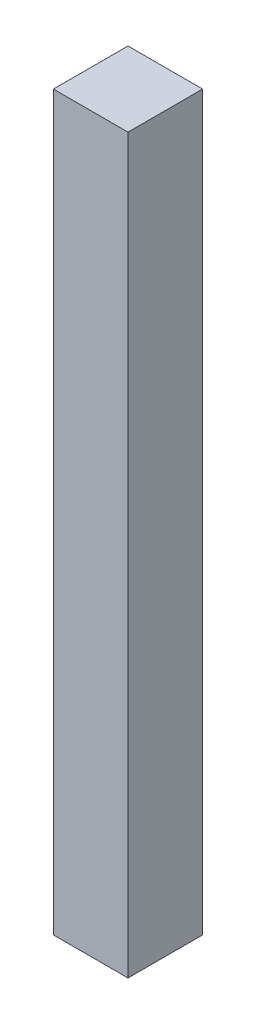
ISO-10303-21;
HEADER;
FILE_DESCRIPTION(('STEP AP214'),'2;1');
FILE_NAME('part.step','',(''),(''),'','','');
FILE_SCHEMA(('AUTOMOTIVE_DESIGN { 1 0 10303 214 1 1 1 1 }'));
ENDSEC;
DATA;
#1=APPLICATION_CONTEXT('core data for automotive mechanical design processes');
#2=APPLICATION_PROTOCOL_DEFINITION('international standard','automotive_design',2000,#1);
#3=PRODUCT_CONTEXT('',#1,'mechanical');
#4=PRODUCT('Part','Part','',(#3));
#5=PRODUCT_RELATED_PRODUCT_CATEGORY('part','',(#4));
#6=PRODUCT_DEFINITION_FORMATION('','',#4);
#7=PRODUCT_DEFINITION_CONTEXT('part definition',#1,'design');
#8=PRODUCT_DEFINITION('design','',#6,#7);
#9=PRODUCT_DEFINITION_SHAPE('','',#8);
#10=(LENGTH_UNIT() NAMED_UNIT(*) SI_UNIT(.MILLI.,.METRE.));
#11=(NAMED_UNIT(*) PLANE_ANGLE_UNIT() SI_UNIT($,.RADIAN.));
#12=(NAMED_UNIT(*) SI_UNIT($,.STERADIAN.) SOLID_ANGLE_UNIT());
#13=UNCERTAINTY_MEASURE_WITH_UNIT(LENGTH_MEASURE(1.E-05),#10,'distance_accuracy_value','');
#14=(GEOMETRIC_REPRESENTATION_CONTEXT(3) GLOBAL_UNCERTAINTY_ASSIGNED_CONTEXT((#13)) GLOBAL_UNIT_ASSIGNED_CONTEXT((#10,
#11,#12)) REPRESENTATION_CONTEXT('',''));
#15=CARTESIAN_POINT('',(0.,0.,0.));
#16=DIRECTION('',(0.,0.,1.));
#17=DIRECTION('',(1.,0.,0.));
#18=AXIS2_PLACEMENT_3D('',#15,#16,#17);
#19=CARTESIAN_POINT('',(16.87,6.43,6.29));
#20=DIRECTION('',(1.,0.,0.));
#21=DIRECTION('',(0.,0.,-1.));
#22=AXIS2_PLACEMENT_3D('',#19,#20,#21);
#23=PLANE('',#22);
#24=DIRECTION('',(0.,1.,0.));
#25=VECTOR('',#24,1.);
#26=CARTESIAN_POINT('',(16.87,3.975,5.79));
#27=LINE('',#26,#25);
#28=CARTESIAN_POINT('',(16.87,6.43,5.79));
#29=VERTEX_POINT('',#28);
#30=CARTESIAN_POINT('',(16.87,1.52,5.79));
#31=VERTEX_POINT('',#30);
#32=EDGE_CURVE('E55',#29,#31,#27,.F.);
#33=ORIENTED_EDGE('',*,*,#32,.F.);
#34=DIRECTION('',(0.,0.,1.));
#35=VECTOR('',#34,1.);
#36=CARTESIAN_POINT('',(16.87,6.43,6.29));
#37=LINE('',#36,#35);
#38=CARTESIAN_POINT('',(16.87,6.43,6.29));
#39=VERTEX_POINT('',#38);
#40=EDGE_CURVE('E67',#39,#29,#37,.F.);
#41=ORIENTED_EDGE('',*,*,#40,.F.);
#42=DIRECTION('',(0.,1.,0.));
#43=VECTOR('',#42,1.);
#44=CARTESIAN_POINT('',(16.87,3.975,6.29));
#45=LINE('',#44,#43);
#46=CARTESIAN_POINT('',(16.87,1.52,6.29));
#47=VERTEX_POINT('',#46);
#48=EDGE_CURVE('E20',#39,#47,#45,.F.);
#49=ORIENTED_EDGE('',*,*,#48,.T.);
#50=DIRECTION('',(0.,0.,-1.));
#51=VECTOR('',#50,1.);
#52=CARTESIAN_POINT('',(16.87,1.52,6.29));
#53=LINE('',#52,#51);
#54=EDGE_CURVE('E81',#31,#47,#53,.F.);
#55=ORIENTED_EDGE('',*,*,#54,.F.);
#56=EDGE_LOOP('',(#33,#41,#49,#55));
#57=FACE_BOUND('',#56,.T.);
#58=ADVANCED_FACE('F17',(#57),#23,.T.);
#59=CARTESIAN_POINT('',(16.62,3.975,6.29));
#60=DIRECTION('',(0.,0.,-1.));
#61=DIRECTION('',(-1.,0.,0.));
#62=AXIS2_PLACEMENT_3D('',#59,#60,#61);
#63=PLANE('',#62);
#64=DIRECTION('',(1.,0.,0.));
#65=VECTOR('',#64,1.);
#66=CARTESIAN_POINT('',(16.37,6.43,6.29));
#67=LINE('',#66,#65);
#68=CARTESIAN_POINT('',(16.37,6.43,6.29));
#69=VERTEX_POINT('',#68);
#70=EDGE_CURVE('E62',#69,#39,#67,.T.);
#71=ORIENTED_EDGE('',*,*,#70,.F.);
#72=DIRECTION('',(0.,1.,0.));
#73=VECTOR('',#72,1.);
#74=CARTESIAN_POINT('',(16.37,1.52,6.29));
#75=LINE('',#74,#73);
#76=CARTESIAN_POINT('',(16.37,1.52,6.29));
#77=VERTEX_POINT('',#76);
#78=EDGE_CURVE('E83',#77,#69,#75,.T.);
#79=ORIENTED_EDGE('',*,*,#78,.F.);
#80=DIRECTION('',(1.,0.,0.));
#81=VECTOR('',#80,1.);
#82=CARTESIAN_POINT('',(16.87,1.52,6.29));
#83=LINE('',#82,#81);
#84=EDGE_CURVE('E65',#47,#77,#83,.F.);
#85=ORIENTED_EDGE('',*,*,#84,.F.);
#86=ORIENTED_EDGE('',*,*,#48,.F.);
#87=EDGE_LOOP('',(#71,#79,#85,#86));
#88=FACE_BOUND('',#87,.T.);
#89=ADVANCED_FACE('F60',(#88),#63,.F.);
#90=CARTESIAN_POINT('',(16.37,6.43,6.29));
#91=DIRECTION('',(0.,1.,0.));
#92=DIRECTION('',(0.,0.,1.));
#93=AXIS2_PLACEMENT_3D('',#90,#91,#92);
#94=PLANE('',#93);
#95=DIRECTION('',(-1.,0.,0.));
#96=VECTOR('',#95,1.);
#97=CARTESIAN_POINT('',(16.62,6.43,5.79));
#98=LINE('',#97,#96);
#99=CARTESIAN_POINT('',(16.37,6.43,5.79));
#100=VERTEX_POINT('',#99);
#101=EDGE_CURVE('E77',#100,#29,#98,.F.);
#102=ORIENTED_EDGE('',*,*,#101,.F.);
#103=DIRECTION('',(0.,0.,1.));
#104=VECTOR('',#103,1.);
#105=CARTESIAN_POINT('',(16.37,6.43,6.29));
#106=LINE('',#105,#104);
#107=EDGE_CURVE('E73',#69,#100,#106,.F.);
#108=ORIENTED_EDGE('',*,*,#107,.F.);
#109=ORIENTED_EDGE('',*,*,#70,.T.);
#110=ORIENTED_EDGE('',*,*,#40,.T.);
#111=EDGE_LOOP('',(#102,#108,#109,#110));
#112=FACE_BOUND('',#111,.T.);
#113=ADVANCED_FACE('F71',(#112),#94,.T.);
#114=CARTESIAN_POINT('',(16.62,3.975,5.79));
#115=DIRECTION('',(0.,0.,-1.));
#116=DIRECTION('',(-1.,0.,0.));
#117=AXIS2_PLACEMENT_3D('',#114,#115,#116);
#118=PLANE('',#117);
#119=DIRECTION('',(0.,1.,0.));
#120=VECTOR('',#119,1.);
#121=CARTESIAN_POINT('',(16.37,1.52,5.79));
#122=LINE('',#121,#120);
#123=CARTESIAN_POINT('',(16.37,1.52,5.79));
#124=VERTEX_POINT('',#123);
#125=EDGE_CURVE('E26',#100,#124,#122,.F.);
#126=ORIENTED_EDGE('',*,*,#125,.F.);
#127=ORIENTED_EDGE('',*,*,#101,.T.);
#128=ORIENTED_EDGE('',*,*,#32,.T.);
#129=DIRECTION('',(1.,0.,0.));
#130=VECTOR('',#129,1.);
#131=CARTESIAN_POINT('',(16.87,1.52,5.79));
#132=LINE('',#131,#130);
#133=EDGE_CURVE('E35',#124,#31,#132,.T.);
#134=ORIENTED_EDGE('',*,*,#133,.F.);
#135=EDGE_LOOP('',(#126,#127,#128,#134));
#136=FACE_BOUND('',#135,.T.);
#137=ADVANCED_FACE('F89',(#136),#118,.T.);
#138=CARTESIAN_POINT('',(16.87,1.52,6.29));
#139=DIRECTION('',(0.,-1.,0.));
#140=DIRECTION('',(0.,0.,-1.));
#141=AXIS2_PLACEMENT_3D('',#138,#139,#140);
#142=PLANE('',#141);
#143=ORIENTED_EDGE('',*,*,#133,.T.);
#144=ORIENTED_EDGE('',*,*,#54,.T.);
#145=ORIENTED_EDGE('',*,*,#84,.T.);
#146=DIRECTION('',(0.,0.,1.));
#147=VECTOR('',#146,1.);
#148=CARTESIAN_POINT('',(16.37,1.52,6.29));
#149=LINE('',#148,#147);
#150=EDGE_CURVE('E11',#124,#77,#149,.T.);
#151=ORIENTED_EDGE('',*,*,#150,.F.);
#152=EDGE_LOOP('',(#143,#144,#145,#151));
#153=FACE_BOUND('',#152,.T.);
#154=ADVANCED_FACE('F91',(#153),#142,.T.);
#155=CARTESIAN_POINT('',(16.37,1.52,6.29));
#156=DIRECTION('',(-1.,0.,0.));
#157=DIRECTION('',(0.,0.,1.));
#158=AXIS2_PLACEMENT_3D('',#155,#156,#157);
#159=PLANE('',#158);
#160=ORIENTED_EDGE('',*,*,#125,.T.);
#161=ORIENTED_EDGE('',*,*,#150,.T.);
#162=ORIENTED_EDGE('',*,*,#78,.T.);
#163=ORIENTED_EDGE('',*,*,#107,.T.);
#164=EDGE_LOOP('',(#160,#161,#162,#163));
#165=FACE_BOUND('',#164,.T.);
#166=ADVANCED_FACE('F88',(#165),#159,.T.);
#167=CLOSED_SHELL('',(#58,#89,#113,#137,#154,#166));
#168=MANIFOLD_SOLID_BREP('B1',#167);
#169=ADVANCED_BREP_SHAPE_REPRESENTATION('',(#18,#168),#14);
#170=SHAPE_DEFINITION_REPRESENTATION(#9,#169);
ENDSEC;
END-ISO-10303-21;
